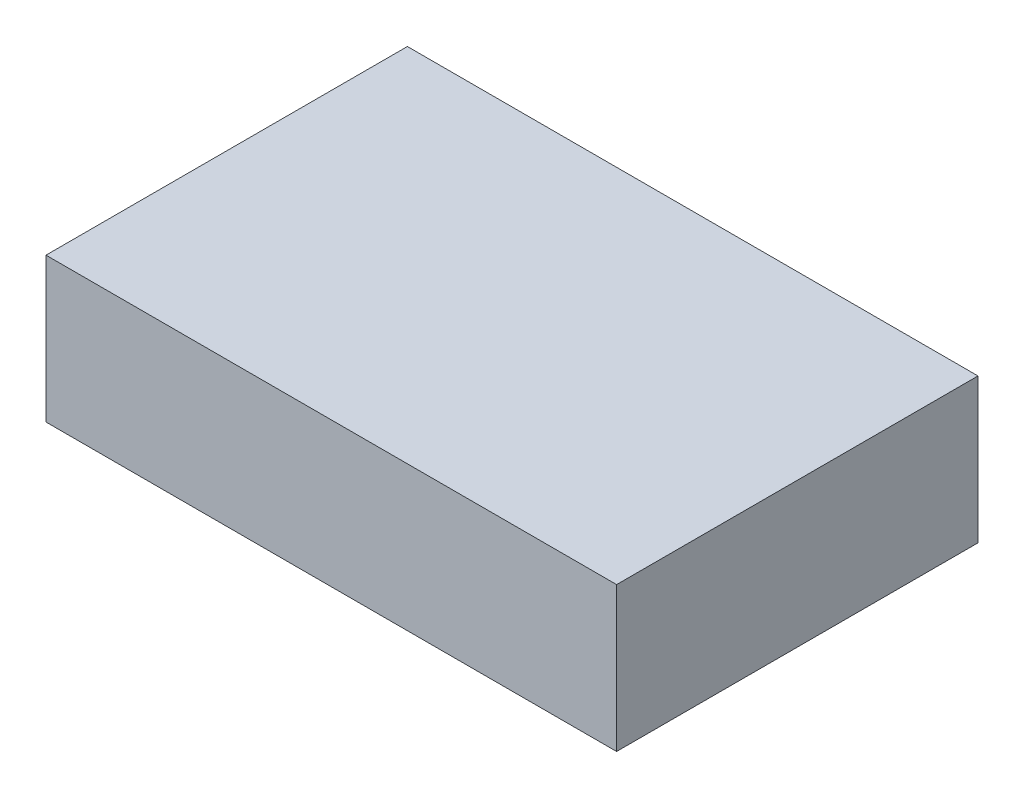
ISO-10303-21;
HEADER;
FILE_DESCRIPTION(('STEP AP214'),'2;1');
FILE_NAME('part.step','',(''),(''),'','','');
FILE_SCHEMA(('AUTOMOTIVE_DESIGN { 1 0 10303 214 1 1 1 1 }'));
ENDSEC;
DATA;
#1=APPLICATION_CONTEXT('core data for automotive mechanical design processes');
#2=APPLICATION_PROTOCOL_DEFINITION('international standard','automotive_design',2000,#1);
#3=PRODUCT_CONTEXT('',#1,'mechanical');
#4=PRODUCT('Part','Part','',(#3));
#5=PRODUCT_RELATED_PRODUCT_CATEGORY('part','',(#4));
#6=PRODUCT_DEFINITION_FORMATION('','',#4);
#7=PRODUCT_DEFINITION_CONTEXT('part definition',#1,'design');
#8=PRODUCT_DEFINITION('design','',#6,#7);
#9=PRODUCT_DEFINITION_SHAPE('','',#8);
#10=(LENGTH_UNIT() NAMED_UNIT(*) SI_UNIT(.MILLI.,.METRE.));
#11=(NAMED_UNIT(*) PLANE_ANGLE_UNIT() SI_UNIT($,.RADIAN.));
#12=(NAMED_UNIT(*) SI_UNIT($,.STERADIAN.) SOLID_ANGLE_UNIT());
#13=UNCERTAINTY_MEASURE_WITH_UNIT(LENGTH_MEASURE(1.E-05),#10,'distance_accuracy_value','');
#14=(GEOMETRIC_REPRESENTATION_CONTEXT(3) GLOBAL_UNCERTAINTY_ASSIGNED_CONTEXT((#13)) GLOBAL_UNIT_ASSIGNED_CONTEXT((#10,
#11,#12)) REPRESENTATION_CONTEXT('',''));
#15=CARTESIAN_POINT('',(0.,0.,0.));
#16=DIRECTION('',(0.,0.,1.));
#17=DIRECTION('',(1.,0.,0.));
#18=AXIS2_PLACEMENT_3D('',#15,#16,#17);
#19=CARTESIAN_POINT('',(19.05,9.652,12.065));
#20=DIRECTION('',(-1.,0.,0.));
#21=DIRECTION('',(0.,0.,1.));
#22=AXIS2_PLACEMENT_3D('',#19,#20,#21);
#23=PLANE('',#22);
#24=DIRECTION('',(0.,0.,-1.));
#25=VECTOR('',#24,1.);
#26=CARTESIAN_POINT('',(19.05,0.,12.065));
#27=LINE('',#26,#25);
#28=CARTESIAN_POINT('',(19.05,0.,12.065));
#29=VERTEX_POINT('',#28);
#30=CARTESIAN_POINT('',(19.05,0.,-12.065));
#31=VERTEX_POINT('',#30);
#32=EDGE_CURVE('E96',#29,#31,#27,.T.);
#33=ORIENTED_EDGE('',*,*,#32,.T.);
#34=DIRECTION('',(0.,-1.,0.));
#35=VECTOR('',#34,1.);
#36=CARTESIAN_POINT('',(19.05,9.652,-12.065));
#37=LINE('',#36,#35);
#38=CARTESIAN_POINT('',(19.05,9.652,-12.065));
#39=VERTEX_POINT('',#38);
#40=EDGE_CURVE('E11',#39,#31,#37,.T.);
#41=ORIENTED_EDGE('',*,*,#40,.F.);
#42=DIRECTION('',(0.,0.,-1.));
#43=VECTOR('',#42,1.);
#44=CARTESIAN_POINT('',(19.05,9.652,12.065));
#45=LINE('',#44,#43);
#46=CARTESIAN_POINT('',(19.05,9.652,12.065));
#47=VERTEX_POINT('',#46);
#48=EDGE_CURVE('E84',#47,#39,#45,.T.);
#49=ORIENTED_EDGE('',*,*,#48,.F.);
#50=DIRECTION('',(0.,-1.,0.));
#51=VECTOR('',#50,1.);
#52=CARTESIAN_POINT('',(19.05,9.652,12.065));
#53=LINE('',#52,#51);
#54=EDGE_CURVE('E92',#47,#29,#53,.T.);
#55=ORIENTED_EDGE('',*,*,#54,.T.);
#56=EDGE_LOOP('',(#33,#41,#49,#55));
#57=FACE_BOUND('',#56,.T.);
#58=ADVANCED_FACE('F33',(#57),#23,.F.);
#59=CARTESIAN_POINT('',(-19.05,9.652,-12.065));
#60=DIRECTION('',(0.,0.,1.));
#61=DIRECTION('',(1.,0.,0.));
#62=AXIS2_PLACEMENT_3D('',#59,#60,#61);
#63=PLANE('',#62);
#64=DIRECTION('',(-1.,0.,0.));
#65=VECTOR('',#64,1.);
#66=CARTESIAN_POINT('',(-19.05,0.,-12.065));
#67=LINE('',#66,#65);
#68=CARTESIAN_POINT('',(-19.05,0.,-12.065));
#69=VERTEX_POINT('',#68);
#70=EDGE_CURVE('E88',#31,#69,#67,.T.);
#71=ORIENTED_EDGE('',*,*,#70,.T.);
#72=DIRECTION('',(0.,-1.,0.));
#73=VECTOR('',#72,1.);
#74=CARTESIAN_POINT('',(-19.05,9.652,-12.065));
#75=LINE('',#74,#73);
#76=CARTESIAN_POINT('',(-19.05,9.652,-12.065));
#77=VERTEX_POINT('',#76);
#78=EDGE_CURVE('E41',#77,#69,#75,.T.);
#79=ORIENTED_EDGE('',*,*,#78,.F.);
#80=DIRECTION('',(-1.,0.,0.));
#81=VECTOR('',#80,1.);
#82=CARTESIAN_POINT('',(-19.05,9.652,-12.065));
#83=LINE('',#82,#81);
#84=EDGE_CURVE('E79',#39,#77,#83,.T.);
#85=ORIENTED_EDGE('',*,*,#84,.F.);
#86=ORIENTED_EDGE('',*,*,#40,.T.);
#87=EDGE_LOOP('',(#71,#79,#85,#86));
#88=FACE_BOUND('',#87,.T.);
#89=ADVANCED_FACE('F87',(#88),#63,.F.);
#90=CARTESIAN_POINT('',(-19.05,9.652,12.065));
#91=DIRECTION('',(1.,0.,0.));
#92=DIRECTION('',(0.,0.,-1.));
#93=AXIS2_PLACEMENT_3D('',#90,#91,#92);
#94=PLANE('',#93);
#95=DIRECTION('',(0.,0.,1.));
#96=VECTOR('',#95,1.);
#97=CARTESIAN_POINT('',(-19.05,0.,12.065));
#98=LINE('',#97,#96);
#99=CARTESIAN_POINT('',(-19.05,0.,12.065));
#100=VERTEX_POINT('',#99);
#101=EDGE_CURVE('E66',#69,#100,#98,.T.);
#102=ORIENTED_EDGE('',*,*,#101,.T.);
#103=DIRECTION('',(0.,-1.,0.));
#104=VECTOR('',#103,1.);
#105=CARTESIAN_POINT('',(-19.05,9.652,12.065));
#106=LINE('',#105,#104);
#107=CARTESIAN_POINT('',(-19.05,9.652,12.065));
#108=VERTEX_POINT('',#107);
#109=EDGE_CURVE('E89',#108,#100,#106,.T.);
#110=ORIENTED_EDGE('',*,*,#109,.F.);
#111=DIRECTION('',(0.,0.,1.));
#112=VECTOR('',#111,1.);
#113=CARTESIAN_POINT('',(-19.05,9.652,12.065));
#114=LINE('',#113,#112);
#115=EDGE_CURVE('E82',#77,#108,#114,.T.);
#116=ORIENTED_EDGE('',*,*,#115,.F.);
#117=ORIENTED_EDGE('',*,*,#78,.T.);
#118=EDGE_LOOP('',(#102,#110,#116,#117));
#119=FACE_BOUND('',#118,.T.);
#120=ADVANCED_FACE('F90',(#119),#94,.F.);
#121=CARTESIAN_POINT('',(-19.05,9.652,12.065));
#122=DIRECTION('',(0.,0.,-1.));
#123=DIRECTION('',(-1.,0.,0.));
#124=AXIS2_PLACEMENT_3D('',#121,#122,#123);
#125=PLANE('',#124);
#126=DIRECTION('',(1.,0.,0.));
#127=VECTOR('',#126,1.);
#128=CARTESIAN_POINT('',(-19.05,0.,12.065));
#129=LINE('',#128,#127);
#130=EDGE_CURVE('E72',#100,#29,#129,.T.);
#131=ORIENTED_EDGE('',*,*,#130,.T.);
#132=ORIENTED_EDGE('',*,*,#54,.F.);
#133=DIRECTION('',(1.,0.,0.));
#134=VECTOR('',#133,1.);
#135=CARTESIAN_POINT('',(-19.05,9.652,12.065));
#136=LINE('',#135,#134);
#137=EDGE_CURVE('E49',#108,#47,#136,.T.);
#138=ORIENTED_EDGE('',*,*,#137,.F.);
#139=ORIENTED_EDGE('',*,*,#109,.T.);
#140=EDGE_LOOP('',(#131,#132,#138,#139));
#141=FACE_BOUND('',#140,.T.);
#142=ADVANCED_FACE('F103',(#141),#125,.F.);
#143=CARTESIAN_POINT('',(0.,9.652,0.));
#144=DIRECTION('',(0.,-1.,0.));
#145=DIRECTION('',(0.,0.,-1.));
#146=AXIS2_PLACEMENT_3D('',#143,#144,#145);
#147=PLANE('',#146);
#148=ORIENTED_EDGE('',*,*,#48,.T.);
#149=ORIENTED_EDGE('',*,*,#84,.T.);
#150=ORIENTED_EDGE('',*,*,#115,.T.);
#151=ORIENTED_EDGE('',*,*,#137,.T.);
#152=EDGE_LOOP('',(#148,#149,#150,#151));
#153=FACE_BOUND('',#152,.T.);
#154=ADVANCED_FACE('F80',(#153),#147,.F.);
#155=CARTESIAN_POINT('',(0.,0.,0.));
#156=DIRECTION('',(0.,-1.,0.));
#157=DIRECTION('',(0.,0.,-1.));
#158=AXIS2_PLACEMENT_3D('',#155,#156,#157);
#159=PLANE('',#158);
#160=ORIENTED_EDGE('',*,*,#32,.F.);
#161=ORIENTED_EDGE('',*,*,#130,.F.);
#162=ORIENTED_EDGE('',*,*,#101,.F.);
#163=ORIENTED_EDGE('',*,*,#70,.F.);
#164=EDGE_LOOP('',(#160,#161,#162,#163));
#165=FACE_BOUND('',#164,.T.);
#166=ADVANCED_FACE('F106',(#165),#159,.T.);
#167=CLOSED_SHELL('',(#58,#89,#120,#142,#154,#166));
#168=MANIFOLD_SOLID_BREP('B2',#167);
#169=ADVANCED_BREP_SHAPE_REPRESENTATION('',(#18,#168),#14);
#170=SHAPE_DEFINITION_REPRESENTATION(#9,#169);
ENDSEC;
END-ISO-10303-21;
